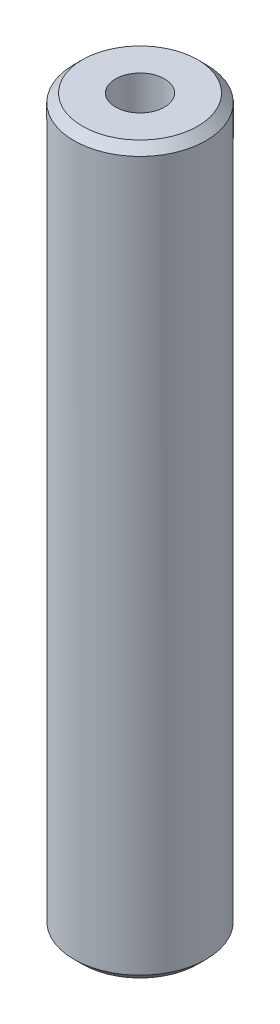
ISO-10303-21;
HEADER;
FILE_DESCRIPTION(('STEP AP214'),'2;1');
FILE_NAME('part.step','',(''),(''),'','','');
FILE_SCHEMA(('AUTOMOTIVE_DESIGN { 1 0 10303 214 1 1 1 1 }'));
ENDSEC;
DATA;
#1=APPLICATION_CONTEXT('core data for automotive mechanical design processes');
#2=APPLICATION_PROTOCOL_DEFINITION('international standard','automotive_design',2000,#1);
#3=PRODUCT_CONTEXT('',#1,'mechanical');
#4=PRODUCT('Part','Part','',(#3));
#5=PRODUCT_RELATED_PRODUCT_CATEGORY('part','',(#4));
#6=PRODUCT_DEFINITION_FORMATION('','',#4);
#7=PRODUCT_DEFINITION_CONTEXT('part definition',#1,'design');
#8=PRODUCT_DEFINITION('design','',#6,#7);
#9=PRODUCT_DEFINITION_SHAPE('','',#8);
#10=(LENGTH_UNIT() NAMED_UNIT(*) SI_UNIT(.MILLI.,.METRE.));
#11=(NAMED_UNIT(*) PLANE_ANGLE_UNIT() SI_UNIT($,.RADIAN.));
#12=(NAMED_UNIT(*) SI_UNIT($,.STERADIAN.) SOLID_ANGLE_UNIT());
#13=UNCERTAINTY_MEASURE_WITH_UNIT(LENGTH_MEASURE(1.E-05),#10,'distance_accuracy_value','');
#14=(GEOMETRIC_REPRESENTATION_CONTEXT(3) GLOBAL_UNCERTAINTY_ASSIGNED_CONTEXT((#13)) GLOBAL_UNIT_ASSIGNED_CONTEXT((#10,
#11,#12)) REPRESENTATION_CONTEXT('',''));
#15=CARTESIAN_POINT('',(0.,0.,0.));
#16=DIRECTION('',(0.,0.,1.));
#17=DIRECTION('',(1.,0.,0.));
#18=AXIS2_PLACEMENT_3D('',#15,#16,#17);
#19=CARTESIAN_POINT('',(0.,494.980243340386,0.));
#20=DIRECTION('',(0.,-1.,0.));
#21=DIRECTION('',(0.,0.,-1.));
#22=AXIS2_PLACEMENT_3D('',#19,#20,#21);
#23=CYLINDRICAL_SURFACE('',#22,45.);
#24=CARTESIAN_POINT('',(0.,489.291046414918,0.));
#25=DIRECTION('',(0.,1.,0.));
#26=DIRECTION('',(0.,0.,1.));
#27=AXIS2_PLACEMENT_3D('',#24,#25,#26);
#28=CIRCLE('',#27,45.);
#29=CARTESIAN_POINT('',(0.,489.291046414918,-45.));
#30=VERTEX_POINT('',#29);
#31=EDGE_CURVE('E50',#30,#30,#28,.F.);
#32=CARTESIAN_POINT('',(0.,5.68919692546838,0.));
#33=DIRECTION('',(0.,1.,0.));
#34=DIRECTION('',(0.,0.,1.));
#35=AXIS2_PLACEMENT_3D('',#32,#33,#34);
#36=CIRCLE('',#35,45.);
#37=CARTESIAN_POINT('',(0.,5.68919692546832,-45.));
#38=VERTEX_POINT('',#37);
#39=EDGE_CURVE('E51',#38,#38,#36,.T.);
#40=CARTESIAN_POINT('',(0.,489.291046414918,-45.));
#41=CARTESIAN_POINT('',(0.,484.253527149403,-45.));
#42=CARTESIAN_POINT('',(0.,479.216007883888,-45.));
#43=CARTESIAN_POINT('',(0.,469.140969352858,-45.));
#44=CARTESIAN_POINT('',(0.,464.103450087343,-45.));
#45=CARTESIAN_POINT('',(0.,454.028411556312,-45.));
#46=CARTESIAN_POINT('',(0.,448.990892290797,-45.));
#47=CARTESIAN_POINT('',(0.,438.915853759767,-45.));
#48=CARTESIAN_POINT('',(0.,433.878334494252,-45.));
#49=CARTESIAN_POINT('',(0.,423.803295963222,-45.));
#50=CARTESIAN_POINT('',(0.,418.765776697707,-45.));
#51=CARTESIAN_POINT('',(0.,408.690738166677,-45.));
#52=CARTESIAN_POINT('',(0.,403.653218901161,-45.));
#53=CARTESIAN_POINT('',(0.,393.578180370131,-45.));
#54=CARTESIAN_POINT('',(0.,388.540661104616,-45.));
#55=CARTESIAN_POINT('',(0.,378.465622573586,-45.));
#56=CARTESIAN_POINT('',(0.,373.428103308071,-45.));
#57=CARTESIAN_POINT('',(0.,363.353064777041,-45.));
#58=CARTESIAN_POINT('',(0.,358.315545511525,-45.));
#59=CARTESIAN_POINT('',(0.,348.240506980495,-45.));
#60=CARTESIAN_POINT('',(0.,343.20298771498,-45.));
#61=CARTESIAN_POINT('',(0.,333.12794918395,-45.));
#62=CARTESIAN_POINT('',(0.,328.090429918435,-45.));
#63=CARTESIAN_POINT('',(0.,318.015391387405,-45.));
#64=CARTESIAN_POINT('',(0.,312.97787212189,-45.));
#65=CARTESIAN_POINT('',(0.,302.902833590859,-45.));
#66=CARTESIAN_POINT('',(0.,297.865314325344,-45.));
#67=CARTESIAN_POINT('',(0.,287.790275794314,-45.));
#68=CARTESIAN_POINT('',(0.,282.752756528799,-45.));
#69=CARTESIAN_POINT('',(0.,272.677717997769,-45.));
#70=CARTESIAN_POINT('',(0.,267.640198732254,-45.));
#71=CARTESIAN_POINT('',(0.,257.565160201223,-45.));
#72=CARTESIAN_POINT('',(0.,252.527640935708,-45.));
#73=CARTESIAN_POINT('',(0.,242.452602404678,-45.));
#74=CARTESIAN_POINT('',(0.,237.415083139163,-45.));
#75=CARTESIAN_POINT('',(0.,227.340044608133,-45.));
#76=CARTESIAN_POINT('',(0.,222.302525342618,-45.));
#77=CARTESIAN_POINT('',(0.,212.227486811588,-45.));
#78=CARTESIAN_POINT('',(0.,207.189967546072,-45.));
#79=CARTESIAN_POINT('',(0.,197.114929015042,-45.));
#80=CARTESIAN_POINT('',(0.,192.077409749527,-45.));
#81=CARTESIAN_POINT('',(0.,182.002371218497,-45.));
#82=CARTESIAN_POINT('',(0.,176.964851952982,-45.));
#83=CARTESIAN_POINT('',(0.,166.889813421952,-45.));
#84=CARTESIAN_POINT('',(0.,161.852294156436,-45.));
#85=CARTESIAN_POINT('',(0.,151.777255625406,-45.));
#86=CARTESIAN_POINT('',(0.,146.739736359891,-45.));
#87=CARTESIAN_POINT('',(0.,136.664697828861,-45.));
#88=CARTESIAN_POINT('',(0.,131.627178563346,-45.));
#89=CARTESIAN_POINT('',(0.,121.552140032316,-45.));
#90=CARTESIAN_POINT('',(0.,116.514620766801,-45.));
#91=CARTESIAN_POINT('',(0.,106.43958223577,-45.));
#92=CARTESIAN_POINT('',(0.,101.402062970255,-45.));
#93=CARTESIAN_POINT('',(0.,91.3270244392251,-45.));
#94=CARTESIAN_POINT('',(0.,86.28950517371,-45.));
#95=CARTESIAN_POINT('',(0.,76.2144666426798,-45.));
#96=CARTESIAN_POINT('',(0.,71.1769473771646,-45.));
#97=CARTESIAN_POINT('',(0.,61.1019088461344,-45.));
#98=CARTESIAN_POINT('',(0.,56.0643895806193,-45.));
#99=CARTESIAN_POINT('',(0.,45.9893510495891,-45.));
#100=CARTESIAN_POINT('',(0.,40.951831784074,-45.));
#101=CARTESIAN_POINT('',(0.,30.8767932530438,-45.));
#102=CARTESIAN_POINT('',(0.,25.8392739875287,-45.));
#103=CARTESIAN_POINT('',(0.,15.7642354564985,-45.));
#104=CARTESIAN_POINT('',(0.,10.7267161909834,-45.));
#105=CARTESIAN_POINT('',(0.,5.68919692546832,-45.));
#106=B_SPLINE_CURVE_WITH_KNOTS('',3,(#40,#41,#42,#43,#44,#45,#46,#47,#48,#49,#50,#51,#52,#53,
#54,#55,#56,#57,#58,#59,#60,#61,#62,#63,#64,#65,#66,#67,#68,#69,#70,#71,#72,#73,#74,#75,#76,#77,
#78,#79,#80,#81,#82,#83,#84,#85,#86,#87,#88,#89,#90,#91,#92,#93,#94,#95,#96,#97,#98,#99,#100,
#101,#102,#103,#104,#105),.UNSPECIFIED.,.F.,.F.,(4,2,2,2,2,2,2,2,2,2,2,2,2,2,2,2,2,2,2,2,2,2,2,
2,2,2,2,2,2,2,2,2,4),(0.,15.1125577965453,30.2251155930906,45.3376733896359,60.4502311861812,
75.5627889827265,90.6753467792718,105.787904575817,120.900462372362,136.013020168908,
151.125577965453,166.238135761998,181.350693558544,196.463251355089,211.575809151634,
226.68836694818,241.800924744725,256.91348254127,272.026040337815,287.138598134361,
302.251155930906,317.363713727451,332.476271523997,347.588829320542,362.701387117087,
377.813944913633,392.926502710178,408.039060506723,423.151618303269,438.264176099814,
453.376733896359,468.489291692904,483.60184948945),.UNSPECIFIED.);
#107=EDGE_CURVE('BSEAM39',#30,#38,#106,.T.);
#108=ORIENTED_EDGE('',*,*,#31,.T.);
#109=ORIENTED_EDGE('',*,*,#39,.T.);
#110=ORIENTED_EDGE('',*,*,#107,.T.);
#111=ORIENTED_EDGE('',*,*,#107,.F.);
#112=EDGE_LOOP('',(#108,#110,#109,#111));
#113=FACE_BOUND('',#112,.T.);
#114=ADVANCED_FACE('F39',(#113),#23,.T.);
#115=CARTESIAN_POINT('',(0.,494.980243340386,0.));
#116=DIRECTION('',(0.,1.,0.));
#117=DIRECTION('',(0.,0.,1.));
#118=AXIS2_PLACEMENT_3D('',#115,#116,#117);
#119=PLANE('',#118);
#120=CARTESIAN_POINT('',(0.,494.980243340386,0.));
#121=DIRECTION('',(0.,1.,0.));
#122=DIRECTION('',(0.,0.,1.));
#123=AXIS2_PLACEMENT_3D('',#120,#121,#122);
#124=CIRCLE('',#123,39.310803074532);
#125=CARTESIAN_POINT('',(0.,494.980243340386,39.310803074532));
#126=VERTEX_POINT('',#125);
#127=EDGE_CURVE('E54',#126,#126,#124,.T.);
#128=ORIENTED_EDGE('',*,*,#127,.T.);
#129=EDGE_LOOP('',(#128));
#130=FACE_BOUND('',#129,.T.);
#131=CARTESIAN_POINT('',(0.,494.980243340386,0.));
#132=DIRECTION('',(0.,1.,0.));
#133=DIRECTION('',(0.,0.,1.));
#134=AXIS2_PLACEMENT_3D('',#131,#132,#133);
#135=CIRCLE('',#134,16.7015953245834);
#136=CARTESIAN_POINT('',(0.,494.980243340386,-16.7015953245834));
#137=VERTEX_POINT('',#136);
#138=EDGE_CURVE('E58',#137,#137,#135,.T.);
#139=ORIENTED_EDGE('',*,*,#138,.F.);
#140=EDGE_LOOP('',(#139));
#141=FACE_BOUND('',#140,.T.);
#142=ADVANCED_FACE('F69',(#130,#141),#119,.T.);
#143=CARTESIAN_POINT('',(0.,0.,0.));
#144=DIRECTION('',(0.,1.,0.));
#145=DIRECTION('',(0.,0.,1.));
#146=AXIS2_PLACEMENT_3D('',#143,#144,#145);
#147=PLANE('',#146);
#148=CARTESIAN_POINT('',(0.,0.,0.));
#149=DIRECTION('',(0.,1.,0.));
#150=DIRECTION('',(0.,0.,1.));
#151=AXIS2_PLACEMENT_3D('',#148,#149,#150);
#152=CIRCLE('',#151,39.3108030745316);
#153=CARTESIAN_POINT('',(0.,0.,39.3108030745316));
#154=VERTEX_POINT('',#153);
#155=EDGE_CURVE('E10',#154,#154,#152,.F.);
#156=ORIENTED_EDGE('',*,*,#155,.T.);
#157=EDGE_LOOP('',(#156));
#158=FACE_BOUND('',#157,.T.);
#159=CARTESIAN_POINT('',(0.,0.,0.));
#160=DIRECTION('',(0.,1.,0.));
#161=DIRECTION('',(0.,0.,1.));
#162=AXIS2_PLACEMENT_3D('',#159,#160,#161);
#163=CIRCLE('',#162,16.7015953245834);
#164=CARTESIAN_POINT('',(0.,0.,-16.7015953245834));
#165=VERTEX_POINT('',#164);
#166=EDGE_CURVE('E63',#165,#165,#163,.T.);
#167=ORIENTED_EDGE('',*,*,#166,.T.);
#168=EDGE_LOOP('',(#167));
#169=FACE_BOUND('',#168,.T.);
#170=ADVANCED_FACE('F75',(#158,#169),#147,.F.);
#171=CARTESIAN_POINT('',(0.,494.980243340386,0.));
#172=DIRECTION('',(0.,-1.,0.));
#173=DIRECTION('',(0.,0.,-1.));
#174=AXIS2_PLACEMENT_3D('',#171,#172,#173);
#175=CYLINDRICAL_SURFACE('',#174,16.7015953245834);
#176=CARTESIAN_POINT('',(0.,494.980243340386,-16.7015953245834));
#177=CARTESIAN_POINT('',(0.,489.824199138924,-16.7015953245834));
#178=CARTESIAN_POINT('',(0.,484.668154937461,-16.7015953245834));
#179=CARTESIAN_POINT('',(0.,474.356066534537,-16.7015953245834));
#180=CARTESIAN_POINT('',(0.,469.200022333074,-16.7015953245834));
#181=CARTESIAN_POINT('',(0.,458.88793393015,-16.7015953245834));
#182=CARTESIAN_POINT('',(0.,453.731889728687,-16.7015953245834));
#183=CARTESIAN_POINT('',(0.,443.419801325763,-16.7015953245834));
#184=CARTESIAN_POINT('',(0.,438.2637571243,-16.7015953245834));
#185=CARTESIAN_POINT('',(0.,427.951668721376,-16.7015953245834));
#186=CARTESIAN_POINT('',(0.,422.795624519913,-16.7015953245834));
#187=CARTESIAN_POINT('',(0.,412.483536116988,-16.7015953245834));
#188=CARTESIAN_POINT('',(0.,407.327491915526,-16.7015953245834));
#189=CARTESIAN_POINT('',(0.,397.015403512601,-16.7015953245834));
#190=CARTESIAN_POINT('',(0.,391.859359311139,-16.7015953245834));
#191=CARTESIAN_POINT('',(0.,381.547270908214,-16.7015953245834));
#192=CARTESIAN_POINT('',(0.,376.391226706752,-16.7015953245834));
#193=CARTESIAN_POINT('',(0.,366.079138303827,-16.7015953245834));
#194=CARTESIAN_POINT('',(0.,360.923094102365,-16.7015953245834));
#195=CARTESIAN_POINT('',(0.,350.61100569944,-16.7015953245834));
#196=CARTESIAN_POINT('',(0.,345.454961497978,-16.7015953245834));
#197=CARTESIAN_POINT('',(0.,335.142873095053,-16.7015953245834));
#198=CARTESIAN_POINT('',(0.,329.986828893591,-16.7015953245834));
#199=CARTESIAN_POINT('',(0.,319.674740490666,-16.7015953245834));
#200=CARTESIAN_POINT('',(0.,314.518696289204,-16.7015953245834));
#201=CARTESIAN_POINT('',(0.,304.206607886279,-16.7015953245834));
#202=CARTESIAN_POINT('',(0.,299.050563684817,-16.7015953245834));
#203=CARTESIAN_POINT('',(0.,288.738475281892,-16.7015953245834));
#204=CARTESIAN_POINT('',(0.,283.58243108043,-16.7015953245834));
#205=CARTESIAN_POINT('',(0.,273.270342677505,-16.7015953245834));
#206=CARTESIAN_POINT('',(0.,268.114298476043,-16.7015953245834));
#207=CARTESIAN_POINT('',(0.,257.802210073118,-16.7015953245834));
#208=CARTESIAN_POINT('',(0.,252.646165871655,-16.7015953245834));
#209=CARTESIAN_POINT('',(0.,242.334077468731,-16.7015953245834));
#210=CARTESIAN_POINT('',(0.,237.178033267268,-16.7015953245834));
#211=CARTESIAN_POINT('',(0.,226.865944864344,-16.7015953245834));
#212=CARTESIAN_POINT('',(0.,221.709900662881,-16.7015953245834));
#213=CARTESIAN_POINT('',(0.,211.397812259957,-16.7015953245834));
#214=CARTESIAN_POINT('',(0.,206.241768058494,-16.7015953245834));
#215=CARTESIAN_POINT('',(0.,195.92967965557,-16.7015953245834));
#216=CARTESIAN_POINT('',(0.,190.773635454107,-16.7015953245834));
#217=CARTESIAN_POINT('',(0.,180.461547051182,-16.7015953245834));
#218=CARTESIAN_POINT('',(0.,175.30550284972,-16.7015953245834));
#219=CARTESIAN_POINT('',(0.,164.993414446795,-16.7015953245834));
#220=CARTESIAN_POINT('',(0.,159.837370245333,-16.7015953245834));
#221=CARTESIAN_POINT('',(0.,149.525281842408,-16.7015953245834));
#222=CARTESIAN_POINT('',(0.,144.369237640946,-16.7015953245834));
#223=CARTESIAN_POINT('',(0.,134.057149238021,-16.7015953245834));
#224=CARTESIAN_POINT('',(0.,128.901105036559,-16.7015953245834));
#225=CARTESIAN_POINT('',(0.,118.589016633634,-16.7015953245834));
#226=CARTESIAN_POINT('',(0.,113.432972432172,-16.7015953245834));
#227=CARTESIAN_POINT('',(0.,103.120884029247,-16.7015953245834));
#228=CARTESIAN_POINT('',(0.,97.9648398277848,-16.7015953245834));
#229=CARTESIAN_POINT('',(0.,87.6527514248601,-16.7015953245834));
#230=CARTESIAN_POINT('',(0.,82.4967072233977,-16.7015953245834));
#231=CARTESIAN_POINT('',(0.,72.184618820473,-16.7015953245834));
#232=CARTESIAN_POINT('',(0.,67.0285746190106,-16.7015953245834));
#233=CARTESIAN_POINT('',(0.,56.7164862160859,-16.7015953245834));
#234=CARTESIAN_POINT('',(0.,51.5604420146235,-16.7015953245834));
#235=CARTESIAN_POINT('',(0.,41.2483536116988,-16.7015953245834));
#236=CARTESIAN_POINT('',(0.,36.0923094102365,-16.7015953245834));
#237=CARTESIAN_POINT('',(0.,25.7802210073118,-16.7015953245834));
#238=CARTESIAN_POINT('',(0.,20.6241768058494,-16.7015953245834));
#239=CARTESIAN_POINT('',(0.,10.3120884029247,-16.7015953245834));
#240=CARTESIAN_POINT('',(0.,5.15604420146235,-16.7015953245834));
#241=CARTESIAN_POINT('',(0.,0.,-16.7015953245834));
#242=B_SPLINE_CURVE_WITH_KNOTS('',3,(#176,#177,#178,#179,#180,#181,#182,#183,#184,#185,#186,
#187,#188,#189,#190,#191,#192,#193,#194,#195,#196,#197,#198,#199,#200,#201,#202,#203,#204,#205,
#206,#207,#208,#209,#210,#211,#212,#213,#214,#215,#216,#217,#218,#219,#220,#221,#222,#223,#224,
#225,#226,#227,#228,#229,#230,#231,#232,#233,#234,#235,#236,#237,#238,#239,#240,#241),
.UNSPECIFIED.,.F.,.F.,(4,2,2,2,2,2,2,2,2,2,2,2,2,2,2,2,2,2,2,2,2,2,2,2,2,2,2,2,2,2,2,2,4),(0.,
15.4681326043871,30.9362652087742,46.4043978131612,61.8725304175483,77.3406630219354,
92.8087956263224,108.27692823071,123.745060835097,139.213193439484,154.681326043871,
170.149458648258,185.617591252645,201.085723857032,216.553856461419,232.021989065806,
247.490121670193,262.95825427458,278.426386878967,293.894519483354,309.362652087741,
324.830784692128,340.298917296516,355.767049900903,371.23518250529,386.703315109677,
402.171447714064,417.639580318451,433.107712922838,448.575845527225,464.043978131612,
479.512110735999,494.980243340386),.UNSPECIFIED.);
#243=EDGE_CURVE('BSEAM70',#137,#165,#242,.T.);
#244=ORIENTED_EDGE('',*,*,#138,.T.);
#245=ORIENTED_EDGE('',*,*,#166,.F.);
#246=ORIENTED_EDGE('',*,*,#243,.T.);
#247=ORIENTED_EDGE('',*,*,#243,.F.);
#248=EDGE_LOOP('',(#244,#246,#245,#247));
#249=FACE_BOUND('',#248,.T.);
#250=ADVANCED_FACE('F70',(#249),#175,.F.);
#251=CARTESIAN_POINT('',(0.,494.980243340386,0.));
#252=DIRECTION('',(0.,-1.,0.));
#253=DIRECTION('',(0.,0.,-1.));
#254=AXIS2_PLACEMENT_3D('',#251,#252,#253);
#255=CONICAL_SURFACE('',#254,39.310803074532,0.785398163397445);
#256=ORIENTED_EDGE('',*,*,#31,.F.);
#257=EDGE_LOOP('',(#256));
#258=FACE_BOUND('',#257,.T.);
#259=ORIENTED_EDGE('',*,*,#127,.F.);
#260=EDGE_LOOP('',(#259));
#261=FACE_BOUND('',#260,.T.);
#262=ADVANCED_FACE('F81',(#258,#261),#255,.T.);
#263=CARTESIAN_POINT('',(0.,5.68919692546838,0.));
#264=DIRECTION('',(0.,1.,0.));
#265=DIRECTION('',(0.,0.,1.));
#266=AXIS2_PLACEMENT_3D('',#263,#264,#265);
#267=CONICAL_SURFACE('',#266,45.,0.785398163397451);
#268=ORIENTED_EDGE('',*,*,#155,.F.);
#269=EDGE_LOOP('',(#268));
#270=FACE_BOUND('',#269,.T.);
#271=ORIENTED_EDGE('',*,*,#39,.F.);
#272=EDGE_LOOP('',(#271));
#273=FACE_BOUND('',#272,.T.);
#274=ADVANCED_FACE('F45',(#270,#273),#267,.T.);
#275=CLOSED_SHELL('',(#114,#142,#170,#250,#262,#274));
#276=MANIFOLD_SOLID_BREP('B2',#275);
#277=ADVANCED_BREP_SHAPE_REPRESENTATION('',(#18,#276),#14);
#278=SHAPE_DEFINITION_REPRESENTATION(#9,#277);
ENDSEC;
END-ISO-10303-21;
